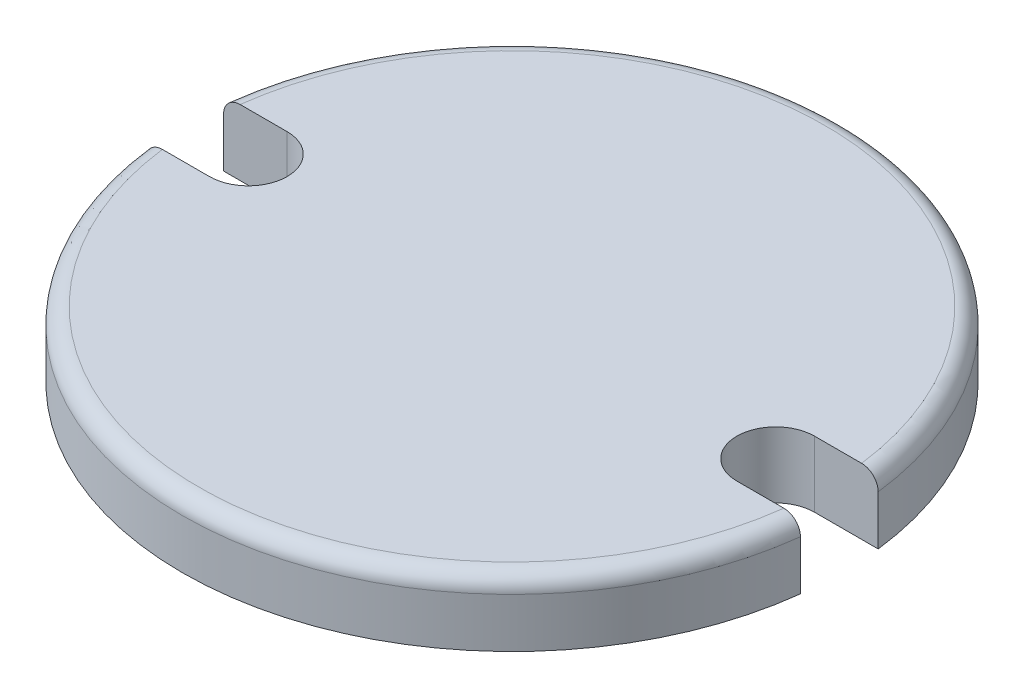
ISO-10303-21;
HEADER;
FILE_DESCRIPTION(('STEP AP214'),'2;1');
FILE_NAME('part.step','',(''),(''),'','','');
FILE_SCHEMA(('AUTOMOTIVE_DESIGN { 1 0 10303 214 1 1 1 1 }'));
ENDSEC;
DATA;
#1=APPLICATION_CONTEXT('core data for automotive mechanical design processes');
#2=APPLICATION_PROTOCOL_DEFINITION('international standard','automotive_design',2000,#1);
#3=PRODUCT_CONTEXT('',#1,'mechanical');
#4=PRODUCT('Part','Part','',(#3));
#5=PRODUCT_RELATED_PRODUCT_CATEGORY('part','',(#4));
#6=PRODUCT_DEFINITION_FORMATION('','',#4);
#7=PRODUCT_DEFINITION_CONTEXT('part definition',#1,'design');
#8=PRODUCT_DEFINITION('design','',#6,#7);
#9=PRODUCT_DEFINITION_SHAPE('','',#8);
#10=(LENGTH_UNIT() NAMED_UNIT(*) SI_UNIT(.MILLI.,.METRE.));
#11=(NAMED_UNIT(*) PLANE_ANGLE_UNIT() SI_UNIT($,.RADIAN.));
#12=(NAMED_UNIT(*) SI_UNIT($,.STERADIAN.) SOLID_ANGLE_UNIT());
#13=UNCERTAINTY_MEASURE_WITH_UNIT(LENGTH_MEASURE(1.E-05),#10,'distance_accuracy_value','');
#14=(GEOMETRIC_REPRESENTATION_CONTEXT(3) GLOBAL_UNCERTAINTY_ASSIGNED_CONTEXT((#13)) GLOBAL_UNIT_ASSIGNED_CONTEXT((#10,
#11,#12)) REPRESENTATION_CONTEXT('',''));
#15=CARTESIAN_POINT('',(0.,0.,0.));
#16=DIRECTION('',(0.,0.,1.));
#17=DIRECTION('',(1.,0.,0.));
#18=AXIS2_PLACEMENT_3D('',#15,#16,#17);
#19=CARTESIAN_POINT('',(0.,12.7,0.));
#20=DIRECTION('',(0.,-1.,0.));
#21=DIRECTION('',(0.,0.,-1.));
#22=AXIS2_PLACEMENT_3D('',#19,#20,#21);
#23=CYLINDRICAL_SURFACE('',#22,63.5);
#24=DIRECTION('',(0.,1.,0.));
#25=VECTOR('',#24,1.);
#26=CARTESIAN_POINT('',(-63.0567197053574,0.,7.49));
#27=LINE('',#26,#25);
#28=CARTESIAN_POINT('',(-63.0567197053574,0.,7.49));
#29=VERTEX_POINT('',#28);
#30=CARTESIAN_POINT('',(-63.0567197053574,9.53,7.49));
#31=VERTEX_POINT('',#30);
#32=EDGE_CURVE('E151',#29,#31,#27,.T.);
#33=ORIENTED_EDGE('',*,*,#32,.F.);
#34=CARTESIAN_POINT('',(0.,0.,0.));
#35=DIRECTION('',(0.,1.,0.));
#36=DIRECTION('',(0.,0.,1.));
#37=AXIS2_PLACEMENT_3D('',#34,#35,#36);
#38=CIRCLE('',#37,63.5);
#39=CARTESIAN_POINT('',(63.0567197053573,0.,7.49));
#40=VERTEX_POINT('',#39);
#41=EDGE_CURVE('E150',#29,#40,#38,.T.);
#42=ORIENTED_EDGE('',*,*,#41,.T.);
#43=DIRECTION('',(0.,1.,0.));
#44=VECTOR('',#43,1.);
#45=CARTESIAN_POINT('',(63.0567197053573,0.,7.49));
#46=LINE('',#45,#44);
#47=CARTESIAN_POINT('',(63.0567197053573,9.53000000003071,7.49));
#48=VERTEX_POINT('',#47);
#49=EDGE_CURVE('E157',#40,#48,#46,.T.);
#50=ORIENTED_EDGE('',*,*,#49,.T.);
#51=CARTESIAN_POINT('',(0.,9.53,0.));
#52=DIRECTION('',(0.,1.,0.));
#53=DIRECTION('',(0.,0.,1.));
#54=AXIS2_PLACEMENT_3D('',#51,#52,#53);
#55=CIRCLE('',#54,63.5);
#56=EDGE_CURVE('E184',#48,#31,#55,.F.);
#57=ORIENTED_EDGE('',*,*,#56,.T.);
#58=EDGE_LOOP('',(#33,#42,#50,#57));
#59=FACE_BOUND('',#58,.T.);
#60=ADVANCED_FACE('F36',(#59),#23,.T.);
#61=CARTESIAN_POINT('',(63.0567197053573,0.,-7.48999999999999));
#62=VERTEX_POINT('',#61);
#63=CARTESIAN_POINT('',(-63.0567197053574,0.,-7.49));
#64=VERTEX_POINT('',#63);
#65=EDGE_CURVE('E179',#62,#64,#38,.T.);
#66=ORIENTED_EDGE('',*,*,#65,.T.);
#67=DIRECTION('',(0.,1.,0.));
#68=VECTOR('',#67,1.);
#69=CARTESIAN_POINT('',(-63.0567197053574,0.,-7.49));
#70=LINE('',#69,#68);
#71=CARTESIAN_POINT('',(-63.0567197053574,9.53000000001508,-7.49));
#72=VERTEX_POINT('',#71);
#73=EDGE_CURVE('E126',#64,#72,#70,.T.);
#74=ORIENTED_EDGE('',*,*,#73,.T.);
#75=CARTESIAN_POINT('',(63.0567197053573,9.53,-7.48999999999999));
#76=VERTEX_POINT('',#75);
#77=EDGE_CURVE('E187',#72,#76,#55,.F.);
#78=ORIENTED_EDGE('',*,*,#77,.T.);
#79=DIRECTION('',(0.,1.,0.));
#80=VECTOR('',#79,1.);
#81=CARTESIAN_POINT('',(63.0567197053573,0.,-7.48999999999999));
#82=LINE('',#81,#80);
#83=EDGE_CURVE('E160',#62,#76,#82,.T.);
#84=ORIENTED_EDGE('',*,*,#83,.F.);
#85=EDGE_LOOP('',(#66,#74,#78,#84));
#86=FACE_BOUND('',#85,.T.);
#87=ADVANCED_FACE('F213',(#86),#23,.T.);
#88=CARTESIAN_POINT('',(0.,12.7,0.));
#89=DIRECTION('',(0.,1.,0.));
#90=DIRECTION('',(0.,0.,1.));
#91=AXIS2_PLACEMENT_3D('',#88,#89,#90);
#92=PLANE('',#91);
#93=CARTESIAN_POINT('',(-50.8,12.7,0.));
#94=DIRECTION('',(0.,1.,0.));
#95=DIRECTION('',(0.,0.,1.));
#96=AXIS2_PLACEMENT_3D('',#93,#94,#95);
#97=CIRCLE('',#96,7.49);
#98=CARTESIAN_POINT('',(-50.8,12.7,7.48999999999999));
#99=VERTEX_POINT('',#98);
#100=CARTESIAN_POINT('',(-50.8,12.7,-7.49));
#101=VERTEX_POINT('',#100);
#102=EDGE_CURVE('E125',#99,#101,#97,.T.);
#103=ORIENTED_EDGE('',*,*,#102,.F.);
#104=DIRECTION('',(-1.,0.,0.));
#105=VECTOR('',#104,1.);
#106=CARTESIAN_POINT('',(-50.8,12.7,7.48999999999999));
#107=LINE('',#106,#105);
#108=CARTESIAN_POINT('',(-59.8632508305388,12.7,7.48999999999999));
#109=VERTEX_POINT('',#108);
#110=EDGE_CURVE('E139',#99,#109,#107,.T.);
#111=ORIENTED_EDGE('',*,*,#110,.T.);
#112=CARTESIAN_POINT('',(0.,12.7,0.));
#113=DIRECTION('',(0.,1.,0.));
#114=DIRECTION('',(0.,0.,1.));
#115=AXIS2_PLACEMENT_3D('',#112,#113,#114);
#116=CIRCLE('',#115,60.33);
#117=CARTESIAN_POINT('',(59.8632508305388,12.7,7.48999999999999));
#118=VERTEX_POINT('',#117);
#119=EDGE_CURVE('E180',#109,#118,#116,.T.);
#120=ORIENTED_EDGE('',*,*,#119,.T.);
#121=DIRECTION('',(1.,0.,0.));
#122=VECTOR('',#121,1.);
#123=CARTESIAN_POINT('',(50.8,12.7,7.48999999999998));
#124=LINE('',#123,#122);
#125=CARTESIAN_POINT('',(50.8,12.7,7.48999999999998));
#126=VERTEX_POINT('',#125);
#127=EDGE_CURVE('E64',#126,#118,#124,.T.);
#128=ORIENTED_EDGE('',*,*,#127,.F.);
#129=CARTESIAN_POINT('',(50.8,12.7,0.));
#130=DIRECTION('',(0.,1.,0.));
#131=DIRECTION('',(0.,0.,1.));
#132=AXIS2_PLACEMENT_3D('',#129,#130,#131);
#133=CIRCLE('',#132,7.49);
#134=CARTESIAN_POINT('',(50.8,12.7,-7.49000000000001));
#135=VERTEX_POINT('',#134);
#136=EDGE_CURVE('E146',#135,#126,#133,.T.);
#137=ORIENTED_EDGE('',*,*,#136,.F.);
#138=DIRECTION('',(1.,0.,0.));
#139=VECTOR('',#138,1.);
#140=CARTESIAN_POINT('',(50.8,12.7,-7.49000000000001));
#141=LINE('',#140,#139);
#142=CARTESIAN_POINT('',(59.8632508305388,12.7,-7.49));
#143=VERTEX_POINT('',#142);
#144=EDGE_CURVE('E164',#135,#143,#141,.T.);
#145=ORIENTED_EDGE('',*,*,#144,.T.);
#146=CARTESIAN_POINT('',(-59.8632508305388,12.7,-7.49));
#147=VERTEX_POINT('',#146);
#148=EDGE_CURVE('E183',#143,#147,#116,.T.);
#149=ORIENTED_EDGE('',*,*,#148,.T.);
#150=DIRECTION('',(-1.,0.,0.));
#151=VECTOR('',#150,1.);
#152=CARTESIAN_POINT('',(-50.8,12.7,-7.49));
#153=LINE('',#152,#151);
#154=EDGE_CURVE('E56',#101,#147,#153,.T.);
#155=ORIENTED_EDGE('',*,*,#154,.F.);
#156=EDGE_LOOP('',(#103,#111,#120,#128,#137,#145,#149,#155));
#157=FACE_BOUND('',#156,.T.);
#158=ADVANCED_FACE('F210',(#157),#92,.T.);
#159=CARTESIAN_POINT('',(0.,0.,0.));
#160=DIRECTION('',(0.,1.,0.));
#161=DIRECTION('',(0.,0.,1.));
#162=AXIS2_PLACEMENT_3D('',#159,#160,#161);
#163=PLANE('',#162);
#164=DIRECTION('',(-1.,0.,0.));
#165=VECTOR('',#164,1.);
#166=CARTESIAN_POINT('',(-50.8,0.,7.48999999999999));
#167=LINE('',#166,#165);
#168=CARTESIAN_POINT('',(-50.8,0.,7.48999999999999));
#169=VERTEX_POINT('',#168);
#170=EDGE_CURVE('E127',#169,#29,#167,.T.);
#171=ORIENTED_EDGE('',*,*,#170,.F.);
#172=CARTESIAN_POINT('',(-50.8,0.,0.));
#173=DIRECTION('',(0.,1.,0.));
#174=DIRECTION('',(0.,0.,1.));
#175=AXIS2_PLACEMENT_3D('',#172,#173,#174);
#176=CIRCLE('',#175,7.49);
#177=CARTESIAN_POINT('',(-50.8,0.,-7.49));
#178=VERTEX_POINT('',#177);
#179=EDGE_CURVE('E122',#169,#178,#176,.T.);
#180=ORIENTED_EDGE('',*,*,#179,.T.);
#181=DIRECTION('',(-1.,0.,0.));
#182=VECTOR('',#181,1.);
#183=CARTESIAN_POINT('',(-50.8,0.,-7.49));
#184=LINE('',#183,#182);
#185=EDGE_CURVE('E130',#178,#64,#184,.T.);
#186=ORIENTED_EDGE('',*,*,#185,.T.);
#187=ORIENTED_EDGE('',*,*,#65,.F.);
#188=DIRECTION('',(1.,0.,0.));
#189=VECTOR('',#188,1.);
#190=CARTESIAN_POINT('',(50.8,0.,-7.49000000000001));
#191=LINE('',#190,#189);
#192=CARTESIAN_POINT('',(50.8,0.,-7.49000000000001));
#193=VERTEX_POINT('',#192);
#194=EDGE_CURVE('E156',#193,#62,#191,.T.);
#195=ORIENTED_EDGE('',*,*,#194,.F.);
#196=CARTESIAN_POINT('',(50.8,0.,0.));
#197=DIRECTION('',(0.,1.,0.));
#198=DIRECTION('',(0.,0.,1.));
#199=AXIS2_PLACEMENT_3D('',#196,#197,#198);
#200=CIRCLE('',#199,7.49);
#201=CARTESIAN_POINT('',(50.8,0.,7.48999999999998));
#202=VERTEX_POINT('',#201);
#203=EDGE_CURVE('E167',#193,#202,#200,.T.);
#204=ORIENTED_EDGE('',*,*,#203,.T.);
#205=DIRECTION('',(1.,0.,0.));
#206=VECTOR('',#205,1.);
#207=CARTESIAN_POINT('',(50.8,0.,7.48999999999998));
#208=LINE('',#207,#206);
#209=EDGE_CURVE('E172',#202,#40,#208,.T.);
#210=ORIENTED_EDGE('',*,*,#209,.T.);
#211=ORIENTED_EDGE('',*,*,#41,.F.);
#212=EDGE_LOOP('',(#171,#180,#186,#187,#195,#204,#210,#211));
#213=FACE_BOUND('',#212,.T.);
#214=ADVANCED_FACE('F137',(#213),#163,.F.);
#215=CARTESIAN_POINT('',(0.,9.53,0.));
#216=DIRECTION('',(0.,1.,0.));
#217=DIRECTION('',(0.,0.,1.));
#218=AXIS2_PLACEMENT_3D('',#215,#216,#217);
#219=TOROIDAL_SURFACE('',#218,60.33,3.17);
#220=ORIENTED_EDGE('',*,*,#119,.F.);
#221=CARTESIAN_POINT('',(-62.1614223401727,11.731306276765,7.48999999999999));
#222=CARTESIAN_POINT('',(-62.2852946426031,11.6038578977068,7.48999999999999));
#223=CARTESIAN_POINT('',(-62.3985427764862,11.4659108518643,7.48999999999999));
#224=CARTESIAN_POINT('',(-62.600396072807,11.1728692531787,7.48999999999999));
#225=CARTESIAN_POINT('',(-62.6889735072531,11.017755677769,7.48999999999999));
#226=CARTESIAN_POINT('',(-62.8387644759281,10.6948579560831,7.48999999999999));
#227=CARTESIAN_POINT('',(-62.8999843619593,10.5270767615268,7.48999999999999));
#228=CARTESIAN_POINT('',(-62.9932503319856,10.1836370282473,7.48999999999999));
#229=CARTESIAN_POINT('',(-63.0253035076103,10.0079804152676,7.48999999999999));
#230=CARTESIAN_POINT('',(-63.059251576378,9.65440954087971,7.48999999999999));
#231=CARTESIAN_POINT('',(-63.061253603326,9.47650556360242,7.48999999999999));
#232=CARTESIAN_POINT('',(-63.0353143152661,9.12289023372835,7.48999999999999));
#233=CARTESIAN_POINT('',(-63.0073723287611,8.94717893039186,7.48999999999999));
#234=CARTESIAN_POINT('',(-62.9224311721181,8.60319434634436,7.48999999999999));
#235=CARTESIAN_POINT('',(-62.8654732754961,8.43491086843113,7.48999999999999));
#236=CARTESIAN_POINT('',(-62.7241927644227,8.11025584789108,7.48999999999999));
#237=CARTESIAN_POINT('',(-62.6398699581198,7.95388438878724,7.48999999999999));
#238=CARTESIAN_POINT('',(-62.4460268793877,7.65698362787045,7.48999999999999));
#239=CARTESIAN_POINT('',(-62.3364342967941,7.51650154724598,7.48999999999999));
#240=CARTESIAN_POINT('',(-62.0953511539783,7.25579078693791,7.48999999999999));
#241=CARTESIAN_POINT('',(-61.9638599993215,7.13556265722395,7.48999999999999));
#242=CARTESIAN_POINT('',(-61.6818619646382,6.91797415977152,7.48999999999999));
#243=CARTESIAN_POINT('',(-61.5312436201257,6.82075826422325,7.48999999999999));
#244=CARTESIAN_POINT('',(-61.2159128940997,6.65278740712932,7.48999999999999));
#245=CARTESIAN_POINT('',(-61.0511999593355,6.5820334848735,7.48999999999999));
#246=CARTESIAN_POINT('',(-60.7111139860179,6.46848242342031,7.48999999999999));
#247=CARTESIAN_POINT('',(-60.5356741329342,6.42588536661705,7.48999999999999));
#248=CARTESIAN_POINT('',(-60.1801438571449,6.37058390234194,7.48999999999999));
#249=CARTESIAN_POINT('',(-60.0000532822127,6.35788047460046,7.48999999999999));
#250=CARTESIAN_POINT('',(-59.6393585138579,6.36270842086306,7.48999999999999));
#251=CARTESIAN_POINT('',(-59.4587563643082,6.38039384381378,7.48999999999999));
#252=CARTESIAN_POINT('',(-59.1030740800365,6.44580709701159,7.48999999999999));
#253=CARTESIAN_POINT('',(-58.9279940171374,6.49353531784094,7.48999999999999));
#254=CARTESIAN_POINT('',(-58.5882098311619,6.61777758578125,7.48999999999999));
#255=CARTESIAN_POINT('',(-58.4235136024898,6.69431323311171,7.48999999999999));
#256=CARTESIAN_POINT('',(-58.1093828509293,6.87406334717446,7.48999999999999));
#257=CARTESIAN_POINT('',(-57.9599480749702,6.97727737141662,7.48999999999999));
#258=CARTESIAN_POINT('',(-57.6813068767858,7.20701363424053,7.48999999999999));
#259=CARTESIAN_POINT('',(-57.5520156528295,7.33343299431888,7.48999999999999));
#260=CARTESIAN_POINT('',(-57.3166948685348,7.60633352327896,7.48999999999999));
#261=CARTESIAN_POINT('',(-57.2106643457532,7.75281386170282,7.48999999999999));
#262=CARTESIAN_POINT('',(-57.0257619652145,8.06046327247997,7.48999999999999));
#263=CARTESIAN_POINT('',(-56.9466853183763,8.22150925844668,7.48999999999999));
#264=CARTESIAN_POINT('',(-56.8169298378264,8.5546616316555,7.48999999999999));
#265=CARTESIAN_POINT('',(-56.7662496771368,8.72676750164625,7.48999999999999));
#266=CARTESIAN_POINT('',(-56.6950948154311,9.07574590889626,7.48999999999999));
#267=CARTESIAN_POINT('',(-56.6743930954699,9.25257218212093,7.48999999999999));
#268=CARTESIAN_POINT('',(-56.6630906718585,9.60718194691089,7.48999999999999));
#269=CARTESIAN_POINT('',(-56.6724891425831,9.78496541208759,7.48999999999999));
#270=CARTESIAN_POINT('',(-56.7210128630496,10.1357629591964,7.48999999999999));
#271=CARTESIAN_POINT('',(-56.7600297053734,10.308792055152,7.48999999999999));
#272=CARTESIAN_POINT('',(-56.8664979245442,10.6458651150035,7.48999999999999));
#273=CARTESIAN_POINT('',(-56.9339493869383,10.8099090518655,7.48999999999999));
#274=CARTESIAN_POINT('',(-57.0954742613987,11.124765460217,7.48999999999999));
#275=CARTESIAN_POINT('',(-57.1896050993742,11.2755484607817,7.48999999999999));
#276=CARTESIAN_POINT('',(-57.4016836378714,11.5593108546896,7.48999999999999));
#277=CARTESIAN_POINT('',(-57.5196321459874,11.6922896440847,7.48999999999999));
#278=CARTESIAN_POINT('',(-57.7768429440186,11.9376545458878,7.48999999999999));
#279=CARTESIAN_POINT('',(-57.9162452914031,12.0498938223432,7.48999999999999));
#280=CARTESIAN_POINT('',(-58.2117880649642,12.2496002890504,7.48999999999999));
#281=CARTESIAN_POINT('',(-58.3679292593907,12.337066341633,7.48999999999999));
#282=CARTESIAN_POINT('',(-58.6938798911671,12.4854774955237,7.48999999999999));
#283=CARTESIAN_POINT('',(-58.8637900059872,12.5462015137849,7.48999999999999));
#284=CARTESIAN_POINT('',(-59.2113559792527,12.6384400985935,7.48999999999999));
#285=CARTESIAN_POINT('',(-59.3890118142141,12.6699547536931,7.48999999999999));
#286=CARTESIAN_POINT('',(-59.7480801745535,12.703014273453,7.48999999999999));
#287=CARTESIAN_POINT('',(-59.9295080009888,12.7043931262604,7.48999999999999));
#288=CARTESIAN_POINT('',(-60.2900762800184,12.6766986979141,7.48999999999999));
#289=CARTESIAN_POINT('',(-60.4692161302586,12.6476175582915,7.48999999999999));
#290=CARTESIAN_POINT('',(-60.8202802263536,12.559725272398,7.48999999999999));
#291=CARTESIAN_POINT('',(-60.9921948761535,12.5008758621385,7.48999999999999));
#292=CARTESIAN_POINT('',(-61.3234905643585,12.3550625585068,7.48999999999999));
#293=CARTESIAN_POINT('',(-61.48288652738,12.2681327946483,7.48999999999999));
#294=CARTESIAN_POINT('',(-61.729181290256,12.1053205278634,7.48999999999999));
#295=CARTESIAN_POINT('',(-61.8212257891681,12.0370825289482,7.48999999999999));
#296=CARTESIAN_POINT('',(-61.9974565815043,11.8911167007274,7.48999999999999));
#297=CARTESIAN_POINT('',(-62.0816428876985,11.8133888868441,7.48999999999999));
#298=CARTESIAN_POINT('',(-62.1614223401727,11.731306276765,7.48999999999999));
#299=B_SPLINE_CURVE_WITH_KNOTS('',3,(#221,#222,#223,#224,#225,#226,#227,#228,#229,#230,#231,
#232,#233,#234,#235,#236,#237,#238,#239,#240,#241,#242,#243,#244,#245,#246,#247,#248,#249,#250,
#251,#252,#253,#254,#255,#256,#257,#258,#259,#260,#261,#262,#263,#264,#265,#266,#267,#268,#269,
#270,#271,#272,#273,#274,#275,#276,#277,#278,#279,#280,#281,#282,#283,#284,#285,#286,#287,#288,
#289,#290,#291,#292,#293,#294,#295,#296,#297,#298),.UNSPECIFIED.,.T.,.F.,(4,2,2,2,2,2,2,2,2,2,2,
2,2,2,2,2,2,2,2,2,2,2,2,2,2,2,2,2,2,2,2,2,2,2,2,2,2,2,4),(0.,0.5327711714434,1.06613874283733,
1.59938241395491,2.13249639688481,2.66370934933687,3.19493421453322,3.72540554313277,
4.25588059087242,4.7878928712386,5.31991959537718,5.85520272558218,6.39050687674088,
6.92957513106931,7.46866105251272,8.01048780872251,8.55232160929245,9.09456249655039,
9.6367943907261,10.1766779999152,10.716539266468,11.2522022636297,11.7878402269805,
12.3194003404917,12.8509458738426,13.3805552003457,13.9101661202165,14.4409257707946,
14.9717034210501,15.5061059191852,16.0405329548891,16.5792988859137,17.1180631835899,
17.6597946778657,18.2016659695762,18.744235556667,19.286148157833,19.6292778211402,
19.9724069268233),.UNSPECIFIED.);
#300=EDGE_CURVE('E11',#109,#31,#299,.T.);
#301=ORIENTED_EDGE('',*,*,#300,.T.);
#302=ORIENTED_EDGE('',*,*,#56,.F.);
#303=CARTESIAN_POINT('',(56.8512680541239,10.5901777181595,7.48999999999999));
#304=CARTESIAN_POINT('',(56.9112862131253,10.757828613047,7.48999999999999));
#305=CARTESIAN_POINT('',(56.9855897623882,10.9205086110824,7.48999999999999));
#306=CARTESIAN_POINT('',(57.1605791308823,11.2311803915423,7.48999999999999));
#307=CARTESIAN_POINT('',(57.2612984731326,11.3791531783364,7.48999999999999));
#308=CARTESIAN_POINT('',(57.4860362713808,11.6560120217772,7.48999999999999));
#309=CARTESIAN_POINT('',(57.6100356552815,11.7849135490093,7.48999999999999));
#310=CARTESIAN_POINT('',(57.8777635473792,12.0201814979261,7.48999999999999));
#311=CARTESIAN_POINT('',(58.0214873119079,12.1265533223558,7.48999999999999));
#312=CARTESIAN_POINT('',(58.3255269301981,12.31449976397,7.48999999999999));
#313=CARTESIAN_POINT('',(58.4859376434265,12.3959209246203,7.48999999999999));
#314=CARTESIAN_POINT('',(58.8180917795963,12.530894047456,7.48999999999999));
#315=CARTESIAN_POINT('',(58.9898361046837,12.5844437880775,7.48999999999999));
#316=CARTESIAN_POINT('',(59.341054570225,12.6624973819348,7.48999999999999));
#317=CARTESIAN_POINT('',(59.520573994664,12.6867975738171,7.48999999999999));
#318=CARTESIAN_POINT('',(59.8811495174771,12.7050070126278,7.48999999999999));
#319=CARTESIAN_POINT('',(60.0622056475516,12.6989156310877,7.48999999999999));
#320=CARTESIAN_POINT('',(60.4212383926555,12.6564330563019,7.48999999999999));
#321=CARTESIAN_POINT('',(60.599205141757,12.6199583765734,7.48999999999999));
#322=CARTESIAN_POINT('',(60.9464655922039,12.5175806449413,7.48999999999999));
#323=CARTESIAN_POINT('',(61.1157593591981,12.4516778158267,7.48999999999999));
#324=CARTESIAN_POINT('',(61.4404244783916,12.2924323459461,7.48999999999999));
#325=CARTESIAN_POINT('',(61.5958272079416,12.1991536960869,7.48999999999999));
#326=CARTESIAN_POINT('',(61.8886417967214,11.9876803757192,7.48999999999999));
#327=CARTESIAN_POINT('',(62.0260541617398,11.8694864059343,7.48999999999999));
#328=CARTESIAN_POINT('',(62.278083919448,11.6122903624415,7.48999999999999));
#329=CARTESIAN_POINT('',(62.392834298874,11.4734186163422,7.48999999999999));
#330=CARTESIAN_POINT('',(62.5971933133971,11.1782658305586,7.48999999999999));
#331=CARTESIAN_POINT('',(62.6868029504415,11.0219854850151,7.48999999999999));
#332=CARTESIAN_POINT('',(62.8376767444231,10.6976405989391,7.48999999999999));
#333=CARTESIAN_POINT('',(62.8991368493683,10.5296671970318,7.48999999999999));
#334=CARTESIAN_POINT('',(62.9928169636856,10.1857559970996,7.48999999999999));
#335=CARTESIAN_POINT('',(63.025037937943,10.0098184620906,7.48999999999999));
#336=CARTESIAN_POINT('',(63.0591907161831,9.65595841390853,7.48999999999999));
#337=CARTESIAN_POINT('',(63.0612798476086,9.4780510685815,7.48999999999999));
#338=CARTESIAN_POINT('',(63.0355129316109,9.12442041877446,7.48999999999999));
#339=CARTESIAN_POINT('',(63.0076573178044,8.94869708270606,7.48999999999999));
#340=CARTESIAN_POINT('',(62.922885267261,8.60467290769764,7.48999999999999));
#341=CARTESIAN_POINT('',(62.8660098844641,8.43636194697239,7.48999999999999));
#342=CARTESIAN_POINT('',(62.7248883795545,8.11163823978074,7.48999999999999));
#343=CARTESIAN_POINT('',(62.6406420115374,7.95522560022593,7.48999999999999));
#344=CARTESIAN_POINT('',(62.4469445860635,7.65823146894467,7.48999999999999));
#345=CARTESIAN_POINT('',(62.3374213844795,7.51769703981321,7.48999999999999));
#346=CARTESIAN_POINT('',(62.0964670614418,7.25687060311373,7.48999999999999));
#347=CARTESIAN_POINT('',(61.9650353127101,7.13657917533464,7.48999999999999));
#348=CARTESIAN_POINT('',(61.6831455248243,6.91885518842941,7.48999999999999));
#349=CARTESIAN_POINT('',(61.5325760190988,6.82156695890325,7.48999999999999));
#350=CARTESIAN_POINT('',(61.2173303280503,6.65344434455378,7.48999999999999));
#351=CARTESIAN_POINT('',(61.0526535968983,6.5826109838766,7.48999999999999));
#352=CARTESIAN_POINT('',(60.7126263247463,6.46889539430846,7.48999999999999));
#353=CARTESIAN_POINT('',(60.5372088595771,6.42621325173495,7.48999999999999));
#354=CARTESIAN_POINT('',(60.1817089803342,6.37073895298881,7.48999999999999));
#355=CARTESIAN_POINT('',(60.0016264168451,6.35794775537391,7.48999999999999));
#356=CARTESIAN_POINT('',(59.6409321284221,6.36259934651353,7.48999999999999));
#357=CARTESIAN_POINT('',(59.4603223736941,6.3801963120243,7.48999999999999));
#358=CARTESIAN_POINT('',(59.1046097580544,6.44543498263236,7.48999999999999));
#359=CARTESIAN_POINT('',(58.9295069789941,6.49307713407674,7.48999999999999));
#360=CARTESIAN_POINT('',(58.5896621182632,6.6171522818986,7.48999999999999));
#361=CARTESIAN_POINT('',(58.4249279786101,6.69360704193355,7.48999999999999));
#362=CARTESIAN_POINT('',(58.110707888901,6.87320290846699,7.48999999999999));
#363=CARTESIAN_POINT('',(57.9612217140965,6.97634362154656,7.48999999999999));
#364=CARTESIAN_POINT('',(57.6824625034692,7.20594599083564,7.48999999999999));
#365=CARTESIAN_POINT('',(57.5531052169097,7.33230533426509,7.48999999999999));
#366=CARTESIAN_POINT('',(57.3176482835449,7.60509314616597,7.48999999999999));
#367=CARTESIAN_POINT('',(57.2115467562247,7.75151999037512,7.48999999999999));
#368=CARTESIAN_POINT('',(57.0265035159322,8.05905798362314,7.48999999999999));
#369=CARTESIAN_POINT('',(56.947354378313,8.22004433230599,7.48999999999999));
#370=CARTESIAN_POINT('',(56.8174261781349,8.55313663309084,7.48999999999999));
#371=CARTESIAN_POINT('',(56.7666529700391,8.7252448716726,7.48999999999999));
#372=CARTESIAN_POINT('',(56.6952961346165,9.07431026535681,7.48999999999999));
#373=CARTESIAN_POINT('',(56.6744997371097,9.25122407354132,7.48999999999999));
#374=CARTESIAN_POINT('',(56.6630692858134,9.6058726786833,7.48999999999999));
#375=CARTESIAN_POINT('',(56.6723974694905,9.78360616911136,7.48999999999999));
#376=CARTESIAN_POINT('',(56.7113946544393,10.0666511150107,7.48999999999999));
#377=CARTESIAN_POINT('',(56.7317763665461,10.1733275603369,7.48999999999999));
#378=CARTESIAN_POINT('',(56.7834265921197,10.384010509485,7.48999999999999));
#379=CARTESIAN_POINT('',(56.8146950514289,10.4880170265861,7.48999999999999));
#380=CARTESIAN_POINT('',(56.8512680541239,10.5901777181595,7.48999999999999));
#381=B_SPLINE_CURVE_WITH_KNOTS('',3,(#303,#304,#305,#306,#307,#308,#309,#310,#311,#312,#313,
#314,#315,#316,#317,#318,#319,#320,#321,#322,#323,#324,#325,#326,#327,#328,#329,#330,#331,#332,
#333,#334,#335,#336,#337,#338,#339,#340,#341,#342,#343,#344,#345,#346,#347,#348,#349,#350,#351,
#352,#353,#354,#355,#356,#357,#358,#359,#360,#361,#362,#363,#364,#365,#366,#367,#368,#369,#370,
#371,#372,#373,#374,#375,#376,#377,#378,#379,#380),.UNSPECIFIED.,.T.,.F.,(4,2,2,2,2,2,2,2,2,2,2,
2,2,2,2,2,2,2,2,2,2,2,2,2,2,2,2,2,2,2,2,2,2,2,2,2,2,2,4),(0.,0.533810706355699,1.06830215209024,
1.60235761327072,2.13628485968537,2.67343294848153,3.21062384550731,3.75153389810854,
4.29245513625737,4.83486762639623,5.37727601020992,5.91842647911229,6.45956173061607,
6.99742037919202,7.53525758915672,8.06929180158554,8.60330839035317,9.13453570197451,
9.66575532123178,10.1962255051771,10.7267004550652,11.2587086108093,11.7907320014466,
12.3260097982582,12.8613083151075,13.4003716302666,13.9394522321399,14.4812759441693,
15.0231077056455,15.565349563753,16.1075834282895,16.6474828727734,17.1873386436096,
17.7229404860975,18.2586527920931,18.7905436581167,19.3217680336684,19.6470555440877,
19.9723414363414),.UNSPECIFIED.);
#382=EDGE_CURVE('E188',#118,#48,#381,.T.);
#383=ORIENTED_EDGE('',*,*,#382,.F.);
#384=EDGE_LOOP('',(#220,#301,#302,#383));
#385=FACE_BOUND('',#384,.T.);
#386=ADVANCED_FACE('F38',(#385),#219,.T.);
#387=CARTESIAN_POINT('',(-62.1614223401727,11.731306276765,-7.49));
#388=CARTESIAN_POINT('',(-62.2852946426031,11.6038578977068,-7.49));
#389=CARTESIAN_POINT('',(-62.3985427764862,11.4659108518643,-7.49));
#390=CARTESIAN_POINT('',(-62.600396072807,11.1728692531787,-7.49));
#391=CARTESIAN_POINT('',(-62.6889735072531,11.017755677769,-7.49));
#392=CARTESIAN_POINT('',(-62.8387644759281,10.6948579560831,-7.49));
#393=CARTESIAN_POINT('',(-62.8999843619593,10.5270767615268,-7.49));
#394=CARTESIAN_POINT('',(-62.9932503319856,10.1836370282473,-7.49));
#395=CARTESIAN_POINT('',(-63.0253035076103,10.0079804152676,-7.49));
#396=CARTESIAN_POINT('',(-63.059251576378,9.6544095408797,-7.49));
#397=CARTESIAN_POINT('',(-63.061253603326,9.47650556360241,-7.49));
#398=CARTESIAN_POINT('',(-63.0353143152661,9.12289023372834,-7.49));
#399=CARTESIAN_POINT('',(-63.0073723287611,8.94717893039185,-7.49));
#400=CARTESIAN_POINT('',(-62.9224311721181,8.60319434634435,-7.49));
#401=CARTESIAN_POINT('',(-62.8654732754961,8.43491086843113,-7.49));
#402=CARTESIAN_POINT('',(-62.7241927644227,8.11025584789108,-7.49));
#403=CARTESIAN_POINT('',(-62.6398699581198,7.95388438878723,-7.49));
#404=CARTESIAN_POINT('',(-62.4460268793877,7.65698362787044,-7.49));
#405=CARTESIAN_POINT('',(-62.3364342967941,7.51650154724596,-7.49));
#406=CARTESIAN_POINT('',(-62.0953511539783,7.25579078693789,-7.49));
#407=CARTESIAN_POINT('',(-61.9638599993215,7.13556265722394,-7.49));
#408=CARTESIAN_POINT('',(-61.6818619646381,6.91797415977151,-7.49));
#409=CARTESIAN_POINT('',(-61.5312436201257,6.82075826422324,-7.49));
#410=CARTESIAN_POINT('',(-61.2159128940997,6.65278740712932,-7.49));
#411=CARTESIAN_POINT('',(-61.0511999593355,6.5820334848735,-7.49));
#412=CARTESIAN_POINT('',(-60.7111139860179,6.46848242342031,-7.49));
#413=CARTESIAN_POINT('',(-60.5356741329342,6.42588536661705,-7.49));
#414=CARTESIAN_POINT('',(-60.1801438571449,6.37058390234194,-7.49));
#415=CARTESIAN_POINT('',(-60.0000532822127,6.35788047460046,-7.49));
#416=CARTESIAN_POINT('',(-59.6393585138579,6.36270842086306,-7.49));
#417=CARTESIAN_POINT('',(-59.4587563643082,6.38039384381378,-7.49));
#418=CARTESIAN_POINT('',(-59.1030740800365,6.4458070970116,-7.49));
#419=CARTESIAN_POINT('',(-58.9279940171374,6.49353531784095,-7.49));
#420=CARTESIAN_POINT('',(-58.5882098311619,6.61777758578126,-7.49));
#421=CARTESIAN_POINT('',(-58.4235136024898,6.69431323311173,-7.49));
#422=CARTESIAN_POINT('',(-58.1093828509292,6.87406334717447,-7.49));
#423=CARTESIAN_POINT('',(-57.9599480749702,6.97727737141663,-7.49));
#424=CARTESIAN_POINT('',(-57.6813068767857,7.20701363424055,-7.49));
#425=CARTESIAN_POINT('',(-57.5520156528295,7.3334329943189,-7.49));
#426=CARTESIAN_POINT('',(-57.3166948685348,7.60633352327897,-7.49));
#427=CARTESIAN_POINT('',(-57.2106643457532,7.75281386170283,-7.49));
#428=CARTESIAN_POINT('',(-57.0257619652145,8.06046327247998,-7.49));
#429=CARTESIAN_POINT('',(-56.9466853183763,8.22150925844669,-7.49));
#430=CARTESIAN_POINT('',(-56.8169298378264,8.55466163165551,-7.49));
#431=CARTESIAN_POINT('',(-56.7662496771368,8.72676750164626,-7.49));
#432=CARTESIAN_POINT('',(-56.6950948154311,9.07574590889627,-7.49));
#433=CARTESIAN_POINT('',(-56.6743930954699,9.25257218212095,-7.49));
#434=CARTESIAN_POINT('',(-56.6630906718585,9.6071819469109,-7.49));
#435=CARTESIAN_POINT('',(-56.6724891425831,9.7849654120876,-7.49));
#436=CARTESIAN_POINT('',(-56.7210128630496,10.1357629591965,-7.49));
#437=CARTESIAN_POINT('',(-56.7600297053734,10.308792055152,-7.49));
#438=CARTESIAN_POINT('',(-56.8664979245442,10.6458651150035,-7.49));
#439=CARTESIAN_POINT('',(-56.9339493869383,10.8099090518655,-7.49));
#440=CARTESIAN_POINT('',(-57.0954742613987,11.124765460217,-7.49));
#441=CARTESIAN_POINT('',(-57.1896050993742,11.2755484607817,-7.49));
#442=CARTESIAN_POINT('',(-57.4016836378715,11.5593108546896,-7.49));
#443=CARTESIAN_POINT('',(-57.5196321459874,11.6922896440847,-7.49));
#444=CARTESIAN_POINT('',(-57.7768429440186,11.9376545458878,-7.49));
#445=CARTESIAN_POINT('',(-57.9162452914031,12.0498938223432,-7.49));
#446=CARTESIAN_POINT('',(-58.2117880649642,12.2496002890504,-7.49));
#447=CARTESIAN_POINT('',(-58.3679292593907,12.337066341633,-7.49));
#448=CARTESIAN_POINT('',(-58.6938798911671,12.4854774955237,-7.49));
#449=CARTESIAN_POINT('',(-58.8637900059873,12.5462015137849,-7.49));
#450=CARTESIAN_POINT('',(-59.2113559792527,12.6384400985935,-7.49));
#451=CARTESIAN_POINT('',(-59.3890118142141,12.6699547536931,-7.49));
#452=CARTESIAN_POINT('',(-59.7480801745535,12.703014273453,-7.49));
#453=CARTESIAN_POINT('',(-59.9295080009888,12.7043931262604,-7.49));
#454=CARTESIAN_POINT('',(-60.2900762800184,12.676698697914,-7.49));
#455=CARTESIAN_POINT('',(-60.4692161302586,12.6476175582915,-7.49));
#456=CARTESIAN_POINT('',(-60.8202802263536,12.559725272398,-7.49));
#457=CARTESIAN_POINT('',(-60.9921948761535,12.5008758621385,-7.49));
#458=CARTESIAN_POINT('',(-61.3234905643585,12.3550625585068,-7.49));
#459=CARTESIAN_POINT('',(-61.48288652738,12.2681327946483,-7.49));
#460=CARTESIAN_POINT('',(-61.729181290256,12.1053205278634,-7.49));
#461=CARTESIAN_POINT('',(-61.8212257891681,12.0370825289482,-7.49));
#462=CARTESIAN_POINT('',(-61.9974565815043,11.8911167007274,-7.49));
#463=CARTESIAN_POINT('',(-62.0816428876985,11.8133888868441,-7.49));
#464=CARTESIAN_POINT('',(-62.1614223401727,11.731306276765,-7.49));
#465=B_SPLINE_CURVE_WITH_KNOTS('',3,(#387,#388,#389,#390,#391,#392,#393,#394,#395,#396,#397,
#398,#399,#400,#401,#402,#403,#404,#405,#406,#407,#408,#409,#410,#411,#412,#413,#414,#415,#416,
#417,#418,#419,#420,#421,#422,#423,#424,#425,#426,#427,#428,#429,#430,#431,#432,#433,#434,#435,
#436,#437,#438,#439,#440,#441,#442,#443,#444,#445,#446,#447,#448,#449,#450,#451,#452,#453,#454,
#455,#456,#457,#458,#459,#460,#461,#462,#463,#464),.UNSPECIFIED.,.T.,.F.,(4,2,2,2,2,2,2,2,2,2,2,
2,2,2,2,2,2,2,2,2,2,2,2,2,2,2,2,2,2,2,2,2,2,2,2,2,2,2,4),(0.,0.532771171443416,1.06613874283735,
1.59938241395493,2.13249639688483,2.66370934933689,3.19493421453323,3.72540554313279,
4.25588059087244,4.78789287123862,5.3199195953772,5.8552027255822,6.39050687674089,
6.92957513106931,7.46866105251273,8.01048780872253,8.55232160929247,9.09456249655041,
9.63679439072611,10.1766779999152,10.716539266468,11.2522022636297,11.7878402269805,
12.3194003404917,12.8509458738426,13.3805552003458,13.9101661202165,14.4409257707946,
14.9717034210501,15.5061059191852,16.0405329548891,16.5792988859137,17.1180631835899,
17.6597946778657,18.2016659695762,18.7442355566671,19.286148157833,19.6292778211402,
19.9724069268232),.UNSPECIFIED.);
#466=EDGE_CURVE('E49',#147,#72,#465,.T.);
#467=ORIENTED_EDGE('',*,*,#466,.F.);
#468=ORIENTED_EDGE('',*,*,#148,.F.);
#469=CARTESIAN_POINT('',(56.8512680541239,10.5901777181595,-7.49));
#470=CARTESIAN_POINT('',(56.9112862131253,10.757828613047,-7.49));
#471=CARTESIAN_POINT('',(56.9855897623882,10.9205086110824,-7.49));
#472=CARTESIAN_POINT('',(57.1605791308823,11.2311803915423,-7.49));
#473=CARTESIAN_POINT('',(57.2612984731326,11.3791531783364,-7.49));
#474=CARTESIAN_POINT('',(57.4860362713808,11.6560120217772,-7.49));
#475=CARTESIAN_POINT('',(57.6100356552815,11.7849135490093,-7.49));
#476=CARTESIAN_POINT('',(57.8777635473792,12.0201814979261,-7.49));
#477=CARTESIAN_POINT('',(58.0214873119079,12.1265533223558,-7.49));
#478=CARTESIAN_POINT('',(58.3255269301981,12.31449976397,-7.49));
#479=CARTESIAN_POINT('',(58.4859376434265,12.3959209246202,-7.49));
#480=CARTESIAN_POINT('',(58.8180917795963,12.530894047456,-7.49));
#481=CARTESIAN_POINT('',(58.9898361046837,12.5844437880775,-7.49));
#482=CARTESIAN_POINT('',(59.341054570225,12.6624973819348,-7.49));
#483=CARTESIAN_POINT('',(59.520573994664,12.6867975738171,-7.49));
#484=CARTESIAN_POINT('',(59.8811495174771,12.7050070126278,-7.49));
#485=CARTESIAN_POINT('',(60.0622056475516,12.6989156310877,-7.49));
#486=CARTESIAN_POINT('',(60.4212383926555,12.6564330563019,-7.49));
#487=CARTESIAN_POINT('',(60.599205141757,12.6199583765734,-7.49));
#488=CARTESIAN_POINT('',(60.9464655922039,12.5175806449413,-7.49));
#489=CARTESIAN_POINT('',(61.1157593591981,12.4516778158267,-7.49));
#490=CARTESIAN_POINT('',(61.4404244783916,12.2924323459461,-7.49));
#491=CARTESIAN_POINT('',(61.5958272079416,12.1991536960869,-7.49));
#492=CARTESIAN_POINT('',(61.8886417967214,11.9876803757192,-7.49));
#493=CARTESIAN_POINT('',(62.0260541617398,11.8694864059343,-7.49));
#494=CARTESIAN_POINT('',(62.278083919448,11.6122903624415,-7.49));
#495=CARTESIAN_POINT('',(62.392834298874,11.4734186163422,-7.49));
#496=CARTESIAN_POINT('',(62.597193313397,11.1782658305586,-7.49));
#497=CARTESIAN_POINT('',(62.6868029504414,11.0219854850151,-7.48999999999999));
#498=CARTESIAN_POINT('',(62.8376767444231,10.6976405989391,-7.48999999999999));
#499=CARTESIAN_POINT('',(62.8991368493683,10.5296671970318,-7.48999999999999));
#500=CARTESIAN_POINT('',(62.9928169636856,10.1857559970996,-7.48999999999999));
#501=CARTESIAN_POINT('',(63.025037937943,10.0098184620906,-7.48999999999999));
#502=CARTESIAN_POINT('',(63.0591907161831,9.65595841390854,-7.48999999999999));
#503=CARTESIAN_POINT('',(63.0612798476086,9.4780510685815,-7.48999999999999));
#504=CARTESIAN_POINT('',(63.0355129316109,9.12442041877446,-7.48999999999999));
#505=CARTESIAN_POINT('',(63.0076573178044,8.94869708270606,-7.48999999999999));
#506=CARTESIAN_POINT('',(62.922885267261,8.60467290769764,-7.48999999999999));
#507=CARTESIAN_POINT('',(62.8660098844641,8.43636194697239,-7.48999999999999));
#508=CARTESIAN_POINT('',(62.7248883795545,8.11163823978073,-7.48999999999999));
#509=CARTESIAN_POINT('',(62.6406420115374,7.95522560022592,-7.49));
#510=CARTESIAN_POINT('',(62.4469445860635,7.65823146894467,-7.49));
#511=CARTESIAN_POINT('',(62.3374213844795,7.51769703981322,-7.49));
#512=CARTESIAN_POINT('',(62.0964670614418,7.25687060311374,-7.49));
#513=CARTESIAN_POINT('',(61.9650353127101,7.13657917533465,-7.49));
#514=CARTESIAN_POINT('',(61.6831455248243,6.91885518842941,-7.49));
#515=CARTESIAN_POINT('',(61.5325760190988,6.82156695890325,-7.49));
#516=CARTESIAN_POINT('',(61.2173303280503,6.65344434455378,-7.49));
#517=CARTESIAN_POINT('',(61.0526535968983,6.58261098387661,-7.49));
#518=CARTESIAN_POINT('',(60.7126263247463,6.46889539430846,-7.49));
#519=CARTESIAN_POINT('',(60.5372088595771,6.42621325173495,-7.49));
#520=CARTESIAN_POINT('',(60.1817089803342,6.37073895298881,-7.49));
#521=CARTESIAN_POINT('',(60.0016264168451,6.35794775537391,-7.49));
#522=CARTESIAN_POINT('',(59.6409321284221,6.36259934651353,-7.49));
#523=CARTESIAN_POINT('',(59.4603223736941,6.3801963120243,-7.49));
#524=CARTESIAN_POINT('',(59.1046097580544,6.44543498263236,-7.49));
#525=CARTESIAN_POINT('',(58.9295069789941,6.49307713407674,-7.49));
#526=CARTESIAN_POINT('',(58.5896621182632,6.6171522818986,-7.49));
#527=CARTESIAN_POINT('',(58.4249279786101,6.69360704193355,-7.49));
#528=CARTESIAN_POINT('',(58.110707888901,6.87320290846699,-7.49));
#529=CARTESIAN_POINT('',(57.9612217140965,6.97634362154656,-7.49));
#530=CARTESIAN_POINT('',(57.6824625034692,7.20594599083564,-7.49));
#531=CARTESIAN_POINT('',(57.5531052169097,7.33230533426509,-7.49));
#532=CARTESIAN_POINT('',(57.3176482835449,7.60509314616597,-7.49));
#533=CARTESIAN_POINT('',(57.2115467562247,7.75151999037512,-7.49));
#534=CARTESIAN_POINT('',(57.0265035159322,8.05905798362314,-7.49));
#535=CARTESIAN_POINT('',(56.947354378313,8.22004433230599,-7.49));
#536=CARTESIAN_POINT('',(56.8174261781349,8.55313663309084,-7.49));
#537=CARTESIAN_POINT('',(56.7666529700391,8.7252448716726,-7.49));
#538=CARTESIAN_POINT('',(56.6952961346165,9.07431026535681,-7.49));
#539=CARTESIAN_POINT('',(56.6744997371097,9.25122407354132,-7.49));
#540=CARTESIAN_POINT('',(56.6630692858134,9.6058726786833,-7.49));
#541=CARTESIAN_POINT('',(56.6723974694905,9.78360616911136,-7.49));
#542=CARTESIAN_POINT('',(56.7113946544393,10.0666511150107,-7.49));
#543=CARTESIAN_POINT('',(56.7317763665461,10.1733275603369,-7.49));
#544=CARTESIAN_POINT('',(56.7834265921197,10.384010509485,-7.49));
#545=CARTESIAN_POINT('',(56.8146950514289,10.4880170265861,-7.49));
#546=CARTESIAN_POINT('',(56.8512680541239,10.5901777181595,-7.49));
#547=B_SPLINE_CURVE_WITH_KNOTS('',3,(#469,#470,#471,#472,#473,#474,#475,#476,#477,#478,#479,
#480,#481,#482,#483,#484,#485,#486,#487,#488,#489,#490,#491,#492,#493,#494,#495,#496,#497,#498,
#499,#500,#501,#502,#503,#504,#505,#506,#507,#508,#509,#510,#511,#512,#513,#514,#515,#516,#517,
#518,#519,#520,#521,#522,#523,#524,#525,#526,#527,#528,#529,#530,#531,#532,#533,#534,#535,#536,
#537,#538,#539,#540,#541,#542,#543,#544,#545,#546),.UNSPECIFIED.,.T.,.F.,(4,2,2,2,2,2,2,2,2,2,2,
2,2,2,2,2,2,2,2,2,2,2,2,2,2,2,2,2,2,2,2,2,2,2,2,2,2,2,4),(0.,0.533810706355695,1.06830215209024,
1.60235761327072,2.13628485968536,2.67343294848152,3.21062384550731,3.75153389810853,
4.29245513625737,4.83486762639623,5.37727601020992,5.91842647911229,6.45956173061608,
6.99742037919201,7.5352575891567,8.06929180158552,8.60330839035315,9.1345357019745,
9.66575532123178,10.1962255051771,10.7267004550652,11.2587086108093,11.7907320014466,
12.3260097982582,12.8613083151075,13.4003716302666,13.9394522321399,14.4812759441693,
15.0231077056455,15.565349563753,16.1075834282895,16.6474828727734,17.1873386436096,
17.7229404860975,18.2586527920931,18.7905436581167,19.3217680336684,19.6470555440877,
19.9723414363414),.UNSPECIFIED.);
#548=EDGE_CURVE('E194',#143,#76,#547,.T.);
#549=ORIENTED_EDGE('',*,*,#548,.T.);
#550=ORIENTED_EDGE('',*,*,#77,.F.);
#551=EDGE_LOOP('',(#467,#468,#549,#550));
#552=FACE_BOUND('',#551,.T.);
#553=ADVANCED_FACE('F238',(#552),#219,.T.);
#554=CARTESIAN_POINT('',(50.8,0.,0.));
#555=DIRECTION('',(0.,1.,0.));
#556=DIRECTION('',(0.,0.,1.));
#557=AXIS2_PLACEMENT_3D('',#554,#555,#556);
#558=CYLINDRICAL_SURFACE('',#557,7.49);
#559=ORIENTED_EDGE('',*,*,#136,.T.);
#560=DIRECTION('',(0.,1.,0.));
#561=VECTOR('',#560,1.);
#562=CARTESIAN_POINT('',(50.8,0.,7.48999999999998));
#563=LINE('',#562,#561);
#564=EDGE_CURVE('E154',#202,#126,#563,.T.);
#565=ORIENTED_EDGE('',*,*,#564,.F.);
#566=ORIENTED_EDGE('',*,*,#203,.F.);
#567=DIRECTION('',(0.,1.,0.));
#568=VECTOR('',#567,1.);
#569=CARTESIAN_POINT('',(50.8,0.,-7.49000000000001));
#570=LINE('',#569,#568);
#571=EDGE_CURVE('E162',#193,#135,#570,.T.);
#572=ORIENTED_EDGE('',*,*,#571,.T.);
#573=EDGE_LOOP('',(#559,#565,#566,#572));
#574=FACE_BOUND('',#573,.T.);
#575=ADVANCED_FACE('F204',(#574),#558,.F.);
#576=CARTESIAN_POINT('',(50.8,0.,-7.49000000000001));
#577=DIRECTION('',(0.,0.,1.));
#578=DIRECTION('',(1.,0.,0.));
#579=AXIS2_PLACEMENT_3D('',#576,#577,#578);
#580=PLANE('',#579);
#581=ORIENTED_EDGE('',*,*,#144,.F.);
#582=ORIENTED_EDGE('',*,*,#571,.F.);
#583=ORIENTED_EDGE('',*,*,#194,.T.);
#584=ORIENTED_EDGE('',*,*,#83,.T.);
#585=ORIENTED_EDGE('',*,*,#548,.F.);
#586=EDGE_LOOP('',(#581,#582,#583,#584,#585));
#587=FACE_BOUND('',#586,.T.);
#588=ADVANCED_FACE('F203',(#587),#580,.T.);
#589=CARTESIAN_POINT('',(50.8,0.,7.48999999999998));
#590=DIRECTION('',(0.,0.,1.));
#591=DIRECTION('',(1.,0.,0.));
#592=AXIS2_PLACEMENT_3D('',#589,#590,#591);
#593=PLANE('',#592);
#594=ORIENTED_EDGE('',*,*,#382,.T.);
#595=ORIENTED_EDGE('',*,*,#49,.F.);
#596=ORIENTED_EDGE('',*,*,#209,.F.);
#597=ORIENTED_EDGE('',*,*,#564,.T.);
#598=ORIENTED_EDGE('',*,*,#127,.T.);
#599=EDGE_LOOP('',(#594,#595,#596,#597,#598));
#600=FACE_BOUND('',#599,.T.);
#601=ADVANCED_FACE('F199',(#600),#593,.F.);
#602=CARTESIAN_POINT('',(-50.8,0.,0.));
#603=DIRECTION('',(0.,1.,0.));
#604=DIRECTION('',(0.,0.,1.));
#605=AXIS2_PLACEMENT_3D('',#602,#603,#604);
#606=CYLINDRICAL_SURFACE('',#605,7.49);
#607=ORIENTED_EDGE('',*,*,#102,.T.);
#608=DIRECTION('',(0.,1.,0.));
#609=VECTOR('',#608,1.);
#610=CARTESIAN_POINT('',(-50.8,0.,-7.49));
#611=LINE('',#610,#609);
#612=EDGE_CURVE('E118',#178,#101,#611,.T.);
#613=ORIENTED_EDGE('',*,*,#612,.F.);
#614=ORIENTED_EDGE('',*,*,#179,.F.);
#615=DIRECTION('',(0.,1.,0.));
#616=VECTOR('',#615,1.);
#617=CARTESIAN_POINT('',(-50.8,0.,7.48999999999999));
#618=LINE('',#617,#616);
#619=EDGE_CURVE('E148',#169,#99,#618,.T.);
#620=ORIENTED_EDGE('',*,*,#619,.T.);
#621=EDGE_LOOP('',(#607,#613,#614,#620));
#622=FACE_BOUND('',#621,.T.);
#623=ADVANCED_FACE('F120',(#622),#606,.F.);
#624=CARTESIAN_POINT('',(-50.8,0.,7.48999999999999));
#625=DIRECTION('',(0.,0.,-1.));
#626=DIRECTION('',(-1.,0.,0.));
#627=AXIS2_PLACEMENT_3D('',#624,#625,#626);
#628=PLANE('',#627);
#629=ORIENTED_EDGE('',*,*,#110,.F.);
#630=ORIENTED_EDGE('',*,*,#619,.F.);
#631=ORIENTED_EDGE('',*,*,#170,.T.);
#632=ORIENTED_EDGE('',*,*,#32,.T.);
#633=ORIENTED_EDGE('',*,*,#300,.F.);
#634=EDGE_LOOP('',(#629,#630,#631,#632,#633));
#635=FACE_BOUND('',#634,.T.);
#636=ADVANCED_FACE('F231',(#635),#628,.T.);
#637=CARTESIAN_POINT('',(-50.8,0.,-7.49));
#638=DIRECTION('',(0.,0.,-1.));
#639=DIRECTION('',(-1.,0.,0.));
#640=AXIS2_PLACEMENT_3D('',#637,#638,#639);
#641=PLANE('',#640);
#642=ORIENTED_EDGE('',*,*,#466,.T.);
#643=ORIENTED_EDGE('',*,*,#73,.F.);
#644=ORIENTED_EDGE('',*,*,#185,.F.);
#645=ORIENTED_EDGE('',*,*,#612,.T.);
#646=ORIENTED_EDGE('',*,*,#154,.T.);
#647=EDGE_LOOP('',(#642,#643,#644,#645,#646));
#648=FACE_BOUND('',#647,.T.);
#649=ADVANCED_FACE('F131',(#648),#641,.F.);
#650=CLOSED_SHELL('',(#60,#87,#158,#214,#386,#553,#575,#588,#601,#623,#636,#649));
#651=MANIFOLD_SOLID_BREP('B2',#650);
#652=ADVANCED_BREP_SHAPE_REPRESENTATION('',(#18,#651),#14);
#653=SHAPE_DEFINITION_REPRESENTATION(#9,#652);
ENDSEC;
END-ISO-10303-21;
